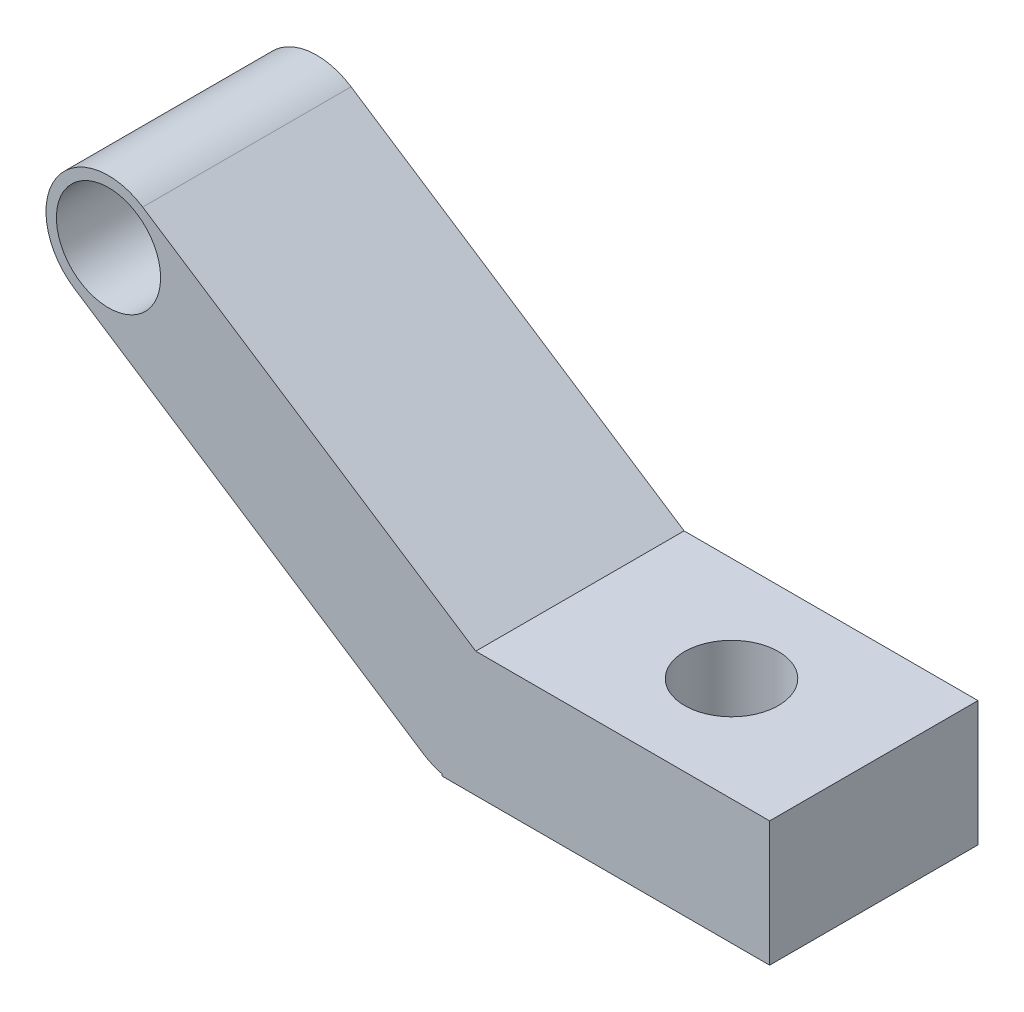
ISO-10303-21;
HEADER;
FILE_DESCRIPTION(('STEP AP214'),'2;1');
FILE_NAME('part.step','',(''),(''),'','','');
FILE_SCHEMA(('AUTOMOTIVE_DESIGN { 1 0 10303 214 1 1 1 1 }'));
ENDSEC;
DATA;
#1=APPLICATION_CONTEXT('core data for automotive mechanical design processes');
#2=APPLICATION_PROTOCOL_DEFINITION('international standard','automotive_design',2000,#1);
#3=PRODUCT_CONTEXT('',#1,'mechanical');
#4=PRODUCT('Part','Part','',(#3));
#5=PRODUCT_RELATED_PRODUCT_CATEGORY('part','',(#4));
#6=PRODUCT_DEFINITION_FORMATION('','',#4);
#7=PRODUCT_DEFINITION_CONTEXT('part definition',#1,'design');
#8=PRODUCT_DEFINITION('design','',#6,#7);
#9=PRODUCT_DEFINITION_SHAPE('','',#8);
#10=(LENGTH_UNIT() NAMED_UNIT(*) SI_UNIT(.MILLI.,.METRE.));
#11=(NAMED_UNIT(*) PLANE_ANGLE_UNIT() SI_UNIT($,.RADIAN.));
#12=(NAMED_UNIT(*) SI_UNIT($,.STERADIAN.) SOLID_ANGLE_UNIT());
#13=UNCERTAINTY_MEASURE_WITH_UNIT(LENGTH_MEASURE(1.E-05),#10,'distance_accuracy_value','');
#14=(GEOMETRIC_REPRESENTATION_CONTEXT(3) GLOBAL_UNCERTAINTY_ASSIGNED_CONTEXT((#13)) GLOBAL_UNIT_ASSIGNED_CONTEXT((#10,
#11,#12)) REPRESENTATION_CONTEXT('',''));
#15=CARTESIAN_POINT('',(0.,0.,0.));
#16=DIRECTION('',(0.,0.,1.));
#17=DIRECTION('',(1.,0.,0.));
#18=AXIS2_PLACEMENT_3D('',#15,#16,#17);
#19=CARTESIAN_POINT('',(0.,0.,200.));
#20=DIRECTION('',(0.,0.,1.));
#21=DIRECTION('',(1.,0.,0.));
#22=AXIS2_PLACEMENT_3D('',#19,#20,#21);
#23=PLANE('',#22);
#24=CARTESIAN_POINT('',(0.,0.,200.));
#25=DIRECTION('',(0.,0.,1.));
#26=DIRECTION('',(1.,0.,0.));
#27=AXIS2_PLACEMENT_3D('',#24,#25,#26);
#28=CIRCLE('',#27,59.9999999999999);
#29=CARTESIAN_POINT('',(-32.8724269129373,-50.1936604448568,200.));
#30=VERTEX_POINT('',#29);
#31=CARTESIAN_POINT('',(-14.3009360266362,-58.2707750829011,200.));
#32=VERTEX_POINT('',#31);
#33=EDGE_CURVE('E180',#30,#32,#28,.T.);
#34=ORIENTED_EDGE('',*,*,#33,.T.);
#35=DIRECTION('',(0.,-1.,0.));
#36=VECTOR('',#35,1.);
#37=CARTESIAN_POINT('',(-14.3009360266362,60.,200.));
#38=LINE('',#37,#36);
#39=CARTESIAN_POINT('',(-14.3009360266362,-60.,200.));
#40=VERTEX_POINT('',#39);
#41=EDGE_CURVE('E148',#32,#40,#38,.T.);
#42=ORIENTED_EDGE('',*,*,#41,.T.);
#43=DIRECTION('',(1.,0.,0.));
#44=VECTOR('',#43,1.);
#45=CARTESIAN_POINT('',(-14.3009360266362,-60.,200.));
#46=LINE('',#45,#44);
#47=CARTESIAN_POINT('',(300.,-60.,200.));
#48=VERTEX_POINT('',#47);
#49=EDGE_CURVE('E145',#40,#48,#46,.T.);
#50=ORIENTED_EDGE('',*,*,#49,.T.);
#51=DIRECTION('',(0.,1.,0.));
#52=VECTOR('',#51,1.);
#53=CARTESIAN_POINT('',(300.,-60.,200.));
#54=LINE('',#53,#52);
#55=CARTESIAN_POINT('',(300.,60.0000000000004,200.));
#56=VERTEX_POINT('',#55);
#57=EDGE_CURVE('E158',#48,#56,#54,.T.);
#58=ORIENTED_EDGE('',*,*,#57,.T.);
#59=DIRECTION('',(-1.,0.,0.));
#60=VECTOR('',#59,1.);
#61=CARTESIAN_POINT('',(-14.3009360266362,60.,200.));
#62=LINE('',#61,#60);
#63=CARTESIAN_POINT('',(17.8989027754745,60.0000000000004,200.));
#64=VERTEX_POINT('',#63);
#65=EDGE_CURVE('E58',#56,#64,#62,.T.);
#66=ORIENTED_EDGE('',*,*,#65,.T.);
#67=DIRECTION('',(-0.836561007414281,0.54787378188229,0.));
#68=VECTOR('',#67,1.);
#69=CARTESIAN_POINT('',(32.8724269129373,50.1936604448567,200.));
#70=LINE('',#69,#68);
#71=CARTESIAN_POINT('',(-301.751976052775,269.343173197773,200.));
#72=VERTEX_POINT('',#71);
#73=EDGE_CURVE('E86',#64,#72,#70,.T.);
#74=ORIENTED_EDGE('',*,*,#73,.T.);
#75=CARTESIAN_POINT('',(-334.624402965712,219.149512752916,200.));
#76=DIRECTION('',(0.,0.,1.));
#77=DIRECTION('',(1.,0.,0.));
#78=AXIS2_PLACEMENT_3D('',#75,#76,#77);
#79=CIRCLE('',#78,60.);
#80=CARTESIAN_POINT('',(-367.49682987865,168.955852308059,200.));
#81=VERTEX_POINT('',#80);
#82=EDGE_CURVE('E185',#72,#81,#79,.T.);
#83=ORIENTED_EDGE('',*,*,#82,.T.);
#84=DIRECTION('',(0.836561007414281,-0.54787378188229,0.));
#85=VECTOR('',#84,1.);
#86=CARTESIAN_POINT('',(-32.8724269129373,-50.1936604448568,200.));
#87=LINE('',#86,#85);
#88=EDGE_CURVE('E66',#81,#30,#87,.T.);
#89=ORIENTED_EDGE('',*,*,#88,.T.);
#90=EDGE_LOOP('',(#34,#42,#50,#58,#66,#74,#83,#89));
#91=FACE_BOUND('',#90,.T.);
#92=CARTESIAN_POINT('',(-334.624402965712,219.149512752916,200.));
#93=DIRECTION('',(0.,0.,1.));
#94=DIRECTION('',(1.,0.,0.));
#95=AXIS2_PLACEMENT_3D('',#92,#93,#94);
#96=CIRCLE('',#95,50.);
#97=CARTESIAN_POINT('',(-284.624402965712,219.149512752916,200.));
#98=VERTEX_POINT('',#97);
#99=EDGE_CURVE('E172',#98,#98,#96,.T.);
#100=ORIENTED_EDGE('',*,*,#99,.F.);
#101=EDGE_LOOP('',(#100));
#102=FACE_BOUND('',#101,.T.);
#103=ADVANCED_FACE('F42',(#91,#102),#23,.T.);
#104=CARTESIAN_POINT('',(0.,0.,0.));
#105=DIRECTION('',(0.,0.,1.));
#106=DIRECTION('',(1.,0.,0.));
#107=AXIS2_PLACEMENT_3D('',#104,#105,#106);
#108=PLANE('',#107);
#109=DIRECTION('',(0.,-1.,0.));
#110=VECTOR('',#109,1.);
#111=CARTESIAN_POINT('',(-14.3009360266362,60.,0.));
#112=LINE('',#111,#110);
#113=CARTESIAN_POINT('',(-14.3009360266362,-58.2707750829011,0.));
#114=VERTEX_POINT('',#113);
#115=CARTESIAN_POINT('',(-14.3009360266362,-60.,0.));
#116=VERTEX_POINT('',#115);
#117=EDGE_CURVE('E138',#114,#116,#112,.T.);
#118=ORIENTED_EDGE('',*,*,#117,.F.);
#119=CARTESIAN_POINT('',(0.,0.,0.));
#120=DIRECTION('',(0.,0.,1.));
#121=DIRECTION('',(1.,0.,0.));
#122=AXIS2_PLACEMENT_3D('',#119,#120,#121);
#123=CIRCLE('',#122,59.9999999999999);
#124=CARTESIAN_POINT('',(-32.8724269129373,-50.1936604448568,0.));
#125=VERTEX_POINT('',#124);
#126=EDGE_CURVE('E176',#125,#114,#123,.T.);
#127=ORIENTED_EDGE('',*,*,#126,.F.);
#128=DIRECTION('',(0.836561007414281,-0.54787378188229,0.));
#129=VECTOR('',#128,1.);
#130=CARTESIAN_POINT('',(-32.8724269129373,-50.1936604448568,0.));
#131=LINE('',#130,#129);
#132=CARTESIAN_POINT('',(-367.49682987865,168.955852308059,0.));
#133=VERTEX_POINT('',#132);
#134=EDGE_CURVE('E83',#133,#125,#131,.T.);
#135=ORIENTED_EDGE('',*,*,#134,.F.);
#136=CARTESIAN_POINT('',(-334.624402965712,219.149512752916,0.));
#137=DIRECTION('',(0.,0.,1.));
#138=DIRECTION('',(1.,0.,0.));
#139=AXIS2_PLACEMENT_3D('',#136,#137,#138);
#140=CIRCLE('',#139,60.);
#141=CARTESIAN_POINT('',(-301.751976052775,269.343173197773,0.));
#142=VERTEX_POINT('',#141);
#143=EDGE_CURVE('E196',#142,#133,#140,.T.);
#144=ORIENTED_EDGE('',*,*,#143,.F.);
#145=DIRECTION('',(-0.836561007414281,0.54787378188229,0.));
#146=VECTOR('',#145,1.);
#147=CARTESIAN_POINT('',(32.8724269129373,50.1936604448567,0.));
#148=LINE('',#147,#146);
#149=CARTESIAN_POINT('',(17.8989027754751,60.,0.));
#150=VERTEX_POINT('',#149);
#151=EDGE_CURVE('E136',#150,#142,#148,.T.);
#152=ORIENTED_EDGE('',*,*,#151,.F.);
#153=DIRECTION('',(-1.,0.,0.));
#154=VECTOR('',#153,1.);
#155=CARTESIAN_POINT('',(-14.3009360266362,60.,0.));
#156=LINE('',#155,#154);
#157=CARTESIAN_POINT('',(300.,60.0000000000004,0.));
#158=VERTEX_POINT('',#157);
#159=EDGE_CURVE('E118',#158,#150,#156,.T.);
#160=ORIENTED_EDGE('',*,*,#159,.F.);
#161=DIRECTION('',(0.,1.,0.));
#162=VECTOR('',#161,1.);
#163=CARTESIAN_POINT('',(300.,-60.,0.));
#164=LINE('',#163,#162);
#165=CARTESIAN_POINT('',(300.,-60.,0.));
#166=VERTEX_POINT('',#165);
#167=EDGE_CURVE('E134',#166,#158,#164,.T.);
#168=ORIENTED_EDGE('',*,*,#167,.F.);
#169=DIRECTION('',(1.,0.,0.));
#170=VECTOR('',#169,1.);
#171=CARTESIAN_POINT('',(-14.3009360266362,-60.,0.));
#172=LINE('',#171,#170);
#173=EDGE_CURVE('E125',#116,#166,#172,.T.);
#174=ORIENTED_EDGE('',*,*,#173,.F.);
#175=EDGE_LOOP('',(#118,#127,#135,#144,#152,#160,#168,#174));
#176=FACE_BOUND('',#175,.T.);
#177=CARTESIAN_POINT('',(-334.624402965712,219.149512752916,0.));
#178=DIRECTION('',(0.,0.,1.));
#179=DIRECTION('',(1.,0.,0.));
#180=AXIS2_PLACEMENT_3D('',#177,#178,#179);
#181=CIRCLE('',#180,50.);
#182=CARTESIAN_POINT('',(-284.624402965712,219.149512752916,0.));
#183=VERTEX_POINT('',#182);
#184=EDGE_CURVE('E168',#183,#183,#181,.T.);
#185=ORIENTED_EDGE('',*,*,#184,.T.);
#186=EDGE_LOOP('',(#185));
#187=FACE_BOUND('',#186,.T.);
#188=ADVANCED_FACE('F131',(#176,#187),#108,.F.);
#189=CARTESIAN_POINT('',(0.,0.,200.));
#190=DIRECTION('',(0.,0.,-1.));
#191=DIRECTION('',(-1.,0.,0.));
#192=AXIS2_PLACEMENT_3D('',#189,#190,#191);
#193=CYLINDRICAL_SURFACE('',#192,59.9999999999999);
#194=ORIENTED_EDGE('',*,*,#126,.T.);
#195=DIRECTION('',(0.,0.,-1.));
#196=VECTOR('',#195,1.);
#197=CARTESIAN_POINT('',(-14.3009360266362,-58.2707750829011,200.));
#198=LINE('',#197,#196);
#199=EDGE_CURVE('E11',#114,#32,#198,.F.);
#200=ORIENTED_EDGE('',*,*,#199,.T.);
#201=ORIENTED_EDGE('',*,*,#33,.F.);
#202=DIRECTION('',(0.,0.,-1.));
#203=VECTOR('',#202,1.);
#204=CARTESIAN_POINT('',(-32.8724269129373,-50.1936604448568,200.));
#205=LINE('',#204,#203);
#206=EDGE_CURVE('E190',#30,#125,#205,.T.);
#207=ORIENTED_EDGE('',*,*,#206,.T.);
#208=EDGE_LOOP('',(#194,#200,#201,#207));
#209=FACE_BOUND('',#208,.T.);
#210=ADVANCED_FACE('F44',(#209),#193,.T.);
#211=CARTESIAN_POINT('',(32.8724269129373,50.1936604448567,200.));
#212=DIRECTION('',(-0.54787378188229,-0.836561007414281,0.));
#213=DIRECTION('',(0.836561007414281,-0.54787378188229,0.));
#214=AXIS2_PLACEMENT_3D('',#211,#212,#213);
#215=PLANE('',#214);
#216=ORIENTED_EDGE('',*,*,#73,.F.);
#217=DIRECTION('',(0.,0.,-1.));
#218=VECTOR('',#217,1.);
#219=CARTESIAN_POINT('',(17.8989027754751,60.,200.));
#220=LINE('',#219,#218);
#221=EDGE_CURVE('E51',#64,#150,#220,.T.);
#222=ORIENTED_EDGE('',*,*,#221,.T.);
#223=ORIENTED_EDGE('',*,*,#151,.T.);
#224=DIRECTION('',(0.,0.,-1.));
#225=VECTOR('',#224,1.);
#226=CARTESIAN_POINT('',(-301.751976052775,269.343173197773,200.));
#227=LINE('',#226,#225);
#228=EDGE_CURVE('E206',#72,#142,#227,.T.);
#229=ORIENTED_EDGE('',*,*,#228,.F.);
#230=EDGE_LOOP('',(#216,#222,#223,#229));
#231=FACE_BOUND('',#230,.T.);
#232=ADVANCED_FACE('F211',(#231),#215,.F.);
#233=CARTESIAN_POINT('',(-334.624402965712,219.149512752916,200.));
#234=DIRECTION('',(0.,0.,-1.));
#235=DIRECTION('',(-1.,0.,0.));
#236=AXIS2_PLACEMENT_3D('',#233,#234,#235);
#237=CYLINDRICAL_SURFACE('',#236,60.);
#238=ORIENTED_EDGE('',*,*,#143,.T.);
#239=DIRECTION('',(0.,0.,-1.));
#240=VECTOR('',#239,1.);
#241=CARTESIAN_POINT('',(-367.49682987865,168.955852308059,200.));
#242=LINE('',#241,#240);
#243=EDGE_CURVE('E203',#81,#133,#242,.T.);
#244=ORIENTED_EDGE('',*,*,#243,.F.);
#245=ORIENTED_EDGE('',*,*,#82,.F.);
#246=ORIENTED_EDGE('',*,*,#228,.T.);
#247=EDGE_LOOP('',(#238,#244,#245,#246));
#248=FACE_BOUND('',#247,.T.);
#249=ADVANCED_FACE('F215',(#248),#237,.T.);
#250=CARTESIAN_POINT('',(-32.8724269129373,-50.1936604448568,200.));
#251=DIRECTION('',(0.54787378188229,0.836561007414281,0.));
#252=DIRECTION('',(-0.836561007414281,0.54787378188229,0.));
#253=AXIS2_PLACEMENT_3D('',#250,#251,#252);
#254=PLANE('',#253);
#255=ORIENTED_EDGE('',*,*,#134,.T.);
#256=ORIENTED_EDGE('',*,*,#206,.F.);
#257=ORIENTED_EDGE('',*,*,#88,.F.);
#258=ORIENTED_EDGE('',*,*,#243,.T.);
#259=EDGE_LOOP('',(#255,#256,#257,#258));
#260=FACE_BOUND('',#259,.T.);
#261=ADVANCED_FACE('F226',(#260),#254,.F.);
#262=CARTESIAN_POINT('',(-334.624402965712,219.149512752916,200.));
#263=DIRECTION('',(0.,0.,-1.));
#264=DIRECTION('',(-1.,0.,0.));
#265=AXIS2_PLACEMENT_3D('',#262,#263,#264);
#266=CYLINDRICAL_SURFACE('',#265,50.);
#267=ORIENTED_EDGE('',*,*,#99,.T.);
#268=EDGE_LOOP('',(#267));
#269=FACE_BOUND('',#268,.T.);
#270=ORIENTED_EDGE('',*,*,#184,.F.);
#271=EDGE_LOOP('',(#270));
#272=FACE_BOUND('',#271,.T.);
#273=ADVANCED_FACE('F222',(#269,#272),#266,.F.);
#274=CARTESIAN_POINT('',(-14.3009360266362,-60.,0.));
#275=DIRECTION('',(0.,-1.,0.));
#276=DIRECTION('',(0.,0.,-1.));
#277=AXIS2_PLACEMENT_3D('',#274,#275,#276);
#278=PLANE('',#277);
#279=CARTESIAN_POINT('',(163.399277188407,-60.0000000000002,100.));
#280=DIRECTION('',(0.,1.,0.));
#281=DIRECTION('',(-1.,0.,0.));
#282=AXIS2_PLACEMENT_3D('',#279,#280,#281);
#283=CIRCLE('',#282,45.);
#284=CARTESIAN_POINT('',(118.399277188407,-60.0000000000002,100.));
#285=VERTEX_POINT('',#284);
#286=EDGE_CURVE('E161',#285,#285,#283,.T.);
#287=ORIENTED_EDGE('',*,*,#286,.T.);
#288=EDGE_LOOP('',(#287));
#289=FACE_BOUND('',#288,.T.);
#290=ORIENTED_EDGE('',*,*,#173,.T.);
#291=DIRECTION('',(0.,0.,1.));
#292=VECTOR('',#291,1.);
#293=CARTESIAN_POINT('',(300.,-60.,0.));
#294=LINE('',#293,#292);
#295=EDGE_CURVE('E143',#166,#48,#294,.T.);
#296=ORIENTED_EDGE('',*,*,#295,.T.);
#297=ORIENTED_EDGE('',*,*,#49,.F.);
#298=DIRECTION('',(0.,0.,1.));
#299=VECTOR('',#298,1.);
#300=CARTESIAN_POINT('',(-14.3009360266362,-60.,0.));
#301=LINE('',#300,#299);
#302=EDGE_CURVE('E124',#116,#40,#301,.T.);
#303=ORIENTED_EDGE('',*,*,#302,.F.);
#304=EDGE_LOOP('',(#290,#296,#297,#303));
#305=FACE_BOUND('',#304,.T.);
#306=ADVANCED_FACE('F225',(#289,#305),#278,.T.);
#307=CARTESIAN_POINT('',(-14.3009360266362,60.,0.));
#308=DIRECTION('',(-1.,0.,0.));
#309=DIRECTION('',(0.,0.,1.));
#310=AXIS2_PLACEMENT_3D('',#307,#308,#309);
#311=PLANE('',#310);
#312=ORIENTED_EDGE('',*,*,#199,.F.);
#313=ORIENTED_EDGE('',*,*,#117,.T.);
#314=ORIENTED_EDGE('',*,*,#302,.T.);
#315=ORIENTED_EDGE('',*,*,#41,.F.);
#316=EDGE_LOOP('',(#312,#313,#314,#315));
#317=FACE_BOUND('',#316,.T.);
#318=ADVANCED_FACE('F265',(#317),#311,.T.);
#319=CARTESIAN_POINT('',(-14.3009360266362,60.,0.));
#320=DIRECTION('',(0.,1.,0.));
#321=DIRECTION('',(-1.,0.,0.));
#322=AXIS2_PLACEMENT_3D('',#319,#320,#321);
#323=PLANE('',#322);
#324=CARTESIAN_POINT('',(163.399277188407,60.0000000000002,100.));
#325=DIRECTION('',(0.,1.,0.));
#326=DIRECTION('',(-1.,0.,0.));
#327=AXIS2_PLACEMENT_3D('',#324,#325,#326);
#328=CIRCLE('',#327,45.);
#329=CARTESIAN_POINT('',(118.399277188407,60.0000000000002,100.));
#330=VERTEX_POINT('',#329);
#331=EDGE_CURVE('E151',#330,#330,#328,.T.);
#332=ORIENTED_EDGE('',*,*,#331,.F.);
#333=EDGE_LOOP('',(#332));
#334=FACE_BOUND('',#333,.T.);
#335=ORIENTED_EDGE('',*,*,#221,.F.);
#336=ORIENTED_EDGE('',*,*,#65,.F.);
#337=DIRECTION('',(0.,0.,1.));
#338=VECTOR('',#337,1.);
#339=CARTESIAN_POINT('',(300.,60.0000000000004,0.));
#340=LINE('',#339,#338);
#341=EDGE_CURVE('E115',#158,#56,#340,.T.);
#342=ORIENTED_EDGE('',*,*,#341,.F.);
#343=ORIENTED_EDGE('',*,*,#159,.T.);
#344=EDGE_LOOP('',(#335,#336,#342,#343));
#345=FACE_BOUND('',#344,.T.);
#346=ADVANCED_FACE('F117',(#334,#345),#323,.T.);
#347=CARTESIAN_POINT('',(300.,-60.,0.));
#348=DIRECTION('',(1.,0.,0.));
#349=DIRECTION('',(0.,0.,-1.));
#350=AXIS2_PLACEMENT_3D('',#347,#348,#349);
#351=PLANE('',#350);
#352=ORIENTED_EDGE('',*,*,#57,.F.);
#353=ORIENTED_EDGE('',*,*,#295,.F.);
#354=ORIENTED_EDGE('',*,*,#167,.T.);
#355=ORIENTED_EDGE('',*,*,#341,.T.);
#356=EDGE_LOOP('',(#352,#353,#354,#355));
#357=FACE_BOUND('',#356,.T.);
#358=ADVANCED_FACE('F141',(#357),#351,.T.);
#359=CARTESIAN_POINT('',(163.399277188407,-60.0000000000002,100.));
#360=DIRECTION('',(0.,1.,0.));
#361=DIRECTION('',(-1.,0.,0.));
#362=AXIS2_PLACEMENT_3D('',#359,#360,#361);
#363=CYLINDRICAL_SURFACE('',#362,45.);
#364=ORIENTED_EDGE('',*,*,#286,.F.);
#365=EDGE_LOOP('',(#364));
#366=FACE_BOUND('',#365,.T.);
#367=ORIENTED_EDGE('',*,*,#331,.T.);
#368=EDGE_LOOP('',(#367));
#369=FACE_BOUND('',#368,.T.);
#370=ADVANCED_FACE('F294',(#366,#369),#363,.F.);
#371=CLOSED_SHELL('',(#103,#188,#210,#232,#249,#261,#273,#306,#318,#346,#358,#370));
#372=MANIFOLD_SOLID_BREP('B2',#371);
#373=ADVANCED_BREP_SHAPE_REPRESENTATION('',(#18,#372),#14);
#374=SHAPE_DEFINITION_REPRESENTATION(#9,#373);
ENDSEC;
END-ISO-10303-21;
